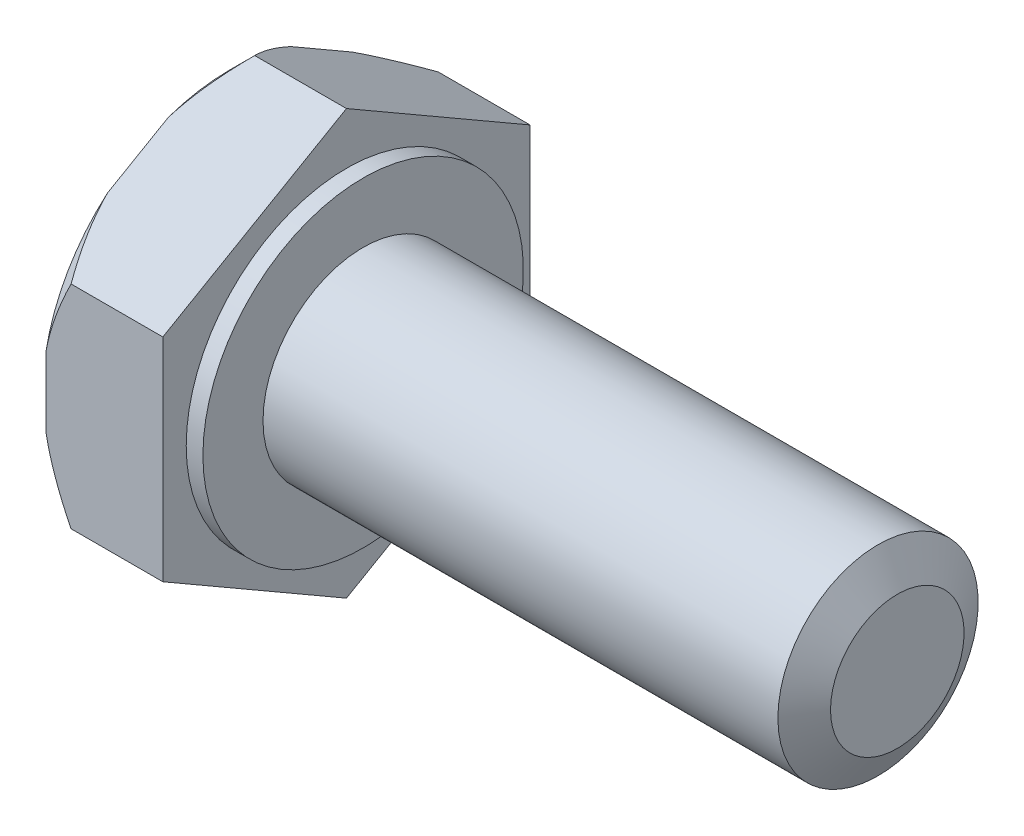
ISO-10303-21;
HEADER;
FILE_DESCRIPTION(('STEP AP214'),'2;1');
FILE_NAME('part.step','',(''),(''),'','','');
FILE_SCHEMA(('AUTOMOTIVE_DESIGN { 1 0 10303 214 1 1 1 1 }'));
ENDSEC;
DATA;
#1=APPLICATION_CONTEXT('core data for automotive mechanical design processes');
#2=APPLICATION_PROTOCOL_DEFINITION('international standard','automotive_design',2000,#1);
#3=PRODUCT_CONTEXT('',#1,'mechanical');
#4=PRODUCT('Part','Part','',(#3));
#5=PRODUCT_RELATED_PRODUCT_CATEGORY('part','',(#4));
#6=PRODUCT_DEFINITION_FORMATION('','',#4);
#7=PRODUCT_DEFINITION_CONTEXT('part definition',#1,'design');
#8=PRODUCT_DEFINITION('design','',#6,#7);
#9=PRODUCT_DEFINITION_SHAPE('','',#8);
#10=(LENGTH_UNIT() NAMED_UNIT(*) SI_UNIT(.MILLI.,.METRE.));
#11=(NAMED_UNIT(*) PLANE_ANGLE_UNIT() SI_UNIT($,.RADIAN.));
#12=(NAMED_UNIT(*) SI_UNIT($,.STERADIAN.) SOLID_ANGLE_UNIT());
#13=UNCERTAINTY_MEASURE_WITH_UNIT(LENGTH_MEASURE(1.E-05),#10,'distance_accuracy_value','');
#14=(GEOMETRIC_REPRESENTATION_CONTEXT(3) GLOBAL_UNCERTAINTY_ASSIGNED_CONTEXT((#13)) GLOBAL_UNIT_ASSIGNED_CONTEXT((#10,
#11,#12)) REPRESENTATION_CONTEXT('',''));
#15=CARTESIAN_POINT('',(0.,0.,0.));
#16=DIRECTION('',(0.,0.,1.));
#17=DIRECTION('',(1.,0.,0.));
#18=AXIS2_PLACEMENT_3D('',#15,#16,#17);
#19=CARTESIAN_POINT('',(-0.25,2.4,0.));
#20=DIRECTION('',(-1.,0.,0.));
#21=DIRECTION('',(0.,0.,1.));
#22=AXIS2_PLACEMENT_3D('',#19,#20,#21);
#23=PLANE('',#22);
#24=CARTESIAN_POINT('',(-0.25,0.,0.));
#25=DIRECTION('',(-1.,0.,0.));
#26=DIRECTION('',(0.,0.,1.));
#27=AXIS2_PLACEMENT_3D('',#24,#25,#26);
#28=CIRCLE('',#27,2.4);
#29=CARTESIAN_POINT('',(-0.25,0.,2.4));
#30=VERTEX_POINT('',#29);
#31=EDGE_CURVE('E228',#30,#30,#28,.T.);
#32=ORIENTED_EDGE('',*,*,#31,.T.);
#33=EDGE_LOOP('',(#32));
#34=FACE_BOUND('',#33,.T.);
#35=DIRECTION('',(0.,-0.5,-0.866025403784439));
#36=VECTOR('',#35,1.);
#37=CARTESIAN_POINT('',(-0.25,2.98156986040721,-0.335769515458674));
#38=LINE('',#37,#36);
#39=CARTESIAN_POINT('',(-0.25,3.17542648054294,0.));
#40=VERTEX_POINT('',#39);
#41=CARTESIAN_POINT('',(-0.25,1.58771324027147,-2.75));
#42=VERTEX_POINT('',#41);
#43=EDGE_CURVE('E12',#40,#42,#38,.T.);
#44=ORIENTED_EDGE('',*,*,#43,.F.);
#45=DIRECTION('',(0.,0.5,-0.866025403784439));
#46=VECTOR('',#45,1.);
#47=CARTESIAN_POINT('',(-0.25,2.98156986040721,0.335769515458674));
#48=LINE('',#47,#46);
#49=CARTESIAN_POINT('',(-0.25,1.58771324027147,2.75));
#50=VERTEX_POINT('',#49);
#51=EDGE_CURVE('E244',#50,#40,#48,.T.);
#52=ORIENTED_EDGE('',*,*,#51,.F.);
#53=DIRECTION('',(0.,1.,0.));
#54=VECTOR('',#53,1.);
#55=CARTESIAN_POINT('',(-0.25,2.4,2.75));
#56=LINE('',#55,#54);
#57=CARTESIAN_POINT('',(-0.25,-1.58771324027147,2.75));
#58=VERTEX_POINT('',#57);
#59=EDGE_CURVE('E147',#58,#50,#56,.T.);
#60=ORIENTED_EDGE('',*,*,#59,.F.);
#61=DIRECTION('',(0.,0.5,0.866025403784439));
#62=VECTOR('',#61,1.);
#63=CARTESIAN_POINT('',(-0.25,-1.7815698604072,2.41423048454133));
#64=LINE('',#63,#62);
#65=CARTESIAN_POINT('',(-0.25,-3.17542648054294,0.));
#66=VERTEX_POINT('',#65);
#67=EDGE_CURVE('E249',#66,#58,#64,.T.);
#68=ORIENTED_EDGE('',*,*,#67,.F.);
#69=DIRECTION('',(0.,-0.5,0.866025403784439));
#70=VECTOR('',#69,1.);
#71=CARTESIAN_POINT('',(-0.25,-1.78156986040721,-2.41423048454132));
#72=LINE('',#71,#70);
#73=CARTESIAN_POINT('',(-0.25,-1.58771324027147,-2.75));
#74=VERTEX_POINT('',#73);
#75=EDGE_CURVE('E252',#74,#66,#72,.T.);
#76=ORIENTED_EDGE('',*,*,#75,.F.);
#77=DIRECTION('',(0.,-1.,0.));
#78=VECTOR('',#77,1.);
#79=CARTESIAN_POINT('',(-0.25,2.4,-2.75));
#80=LINE('',#79,#78);
#81=EDGE_CURVE('E55',#42,#74,#80,.T.);
#82=ORIENTED_EDGE('',*,*,#81,.F.);
#83=EDGE_LOOP('',(#44,#52,#60,#68,#76,#82));
#84=FACE_BOUND('',#83,.T.);
#85=ADVANCED_FACE('F46',(#34,#84),#23,.F.);
#86=CARTESIAN_POINT('',(-88.99,0.,0.));
#87=DIRECTION('',(-1.,0.,0.));
#88=DIRECTION('',(0.,0.,1.));
#89=AXIS2_PLACEMENT_3D('',#86,#87,#88);
#90=CYLINDRICAL_SURFACE('',#89,1.5);
#91=CARTESIAN_POINT('',(0.,0.,0.));
#92=DIRECTION('',(-1.,0.,0.));
#93=DIRECTION('',(0.,0.,1.));
#94=AXIS2_PLACEMENT_3D('',#91,#92,#93);
#95=CIRCLE('',#94,1.49999999999999);
#96=CARTESIAN_POINT('',(0.,0.,1.49999999999999));
#97=VERTEX_POINT('',#96);
#98=EDGE_CURVE('E220',#97,#97,#95,.T.);
#99=ORIENTED_EDGE('',*,*,#98,.F.);
#100=EDGE_LOOP('',(#99));
#101=FACE_BOUND('',#100,.T.);
#102=CARTESIAN_POINT('',(7.71132486540518,0.,0.));
#103=DIRECTION('',(-1.,0.,0.));
#104=DIRECTION('',(0.,0.,1.));
#105=AXIS2_PLACEMENT_3D('',#102,#103,#104);
#106=CIRCLE('',#105,1.5);
#107=CARTESIAN_POINT('',(7.71132486540518,0.,1.5));
#108=VERTEX_POINT('',#107);
#109=EDGE_CURVE('E240',#108,#108,#106,.T.);
#110=ORIENTED_EDGE('',*,*,#109,.T.);
#111=EDGE_LOOP('',(#110));
#112=FACE_BOUND('',#111,.T.);
#113=ADVANCED_FACE('F48',(#101,#112),#90,.T.);
#114=CARTESIAN_POINT('',(7.99999999999999,0.,0.));
#115=DIRECTION('',(-1.,0.,0.));
#116=DIRECTION('',(0.,0.,1.));
#117=AXIS2_PLACEMENT_3D('',#114,#115,#116);
#118=CONICAL_SURFACE('',#117,0.999999999999993,1.04719755119661);
#119=ORIENTED_EDGE('',*,*,#109,.F.);
#120=EDGE_LOOP('',(#119));
#121=FACE_BOUND('',#120,.T.);
#122=CARTESIAN_POINT('',(7.99999999999999,0.,0.));
#123=DIRECTION('',(-1.,0.,0.));
#124=DIRECTION('',(0.,0.,1.));
#125=AXIS2_PLACEMENT_3D('',#122,#123,#124);
#126=CIRCLE('',#125,0.999999999999993);
#127=CARTESIAN_POINT('',(7.99999999999999,0.,0.999999999999993));
#128=VERTEX_POINT('',#127);
#129=EDGE_CURVE('E235',#128,#128,#126,.T.);
#130=ORIENTED_EDGE('',*,*,#129,.T.);
#131=EDGE_LOOP('',(#130));
#132=FACE_BOUND('',#131,.T.);
#133=ADVANCED_FACE('F364',(#121,#132),#118,.T.);
#134=CARTESIAN_POINT('',(8.,0.,0.));
#135=DIRECTION('',(-1.,0.,0.));
#136=DIRECTION('',(0.,0.,1.));
#137=AXIS2_PLACEMENT_3D('',#134,#135,#136);
#138=PLANE('',#137);
#139=ORIENTED_EDGE('',*,*,#129,.F.);
#140=EDGE_LOOP('',(#139));
#141=FACE_BOUND('',#140,.T.);
#142=ADVANCED_FACE('F368',(#141),#138,.F.);
#143=CARTESIAN_POINT('',(-88.99,0.,0.));
#144=DIRECTION('',(-1.,0.,0.));
#145=DIRECTION('',(0.,0.,1.));
#146=AXIS2_PLACEMENT_3D('',#143,#144,#145);
#147=CYLINDRICAL_SURFACE('',#146,2.4);
#148=ORIENTED_EDGE('',*,*,#31,.F.);
#149=EDGE_LOOP('',(#148));
#150=FACE_BOUND('',#149,.T.);
#151=CARTESIAN_POINT('',(0.,0.,0.));
#152=DIRECTION('',(-1.,0.,0.));
#153=DIRECTION('',(0.,0.,1.));
#154=AXIS2_PLACEMENT_3D('',#151,#152,#153);
#155=CIRCLE('',#154,2.4);
#156=CARTESIAN_POINT('',(0.,0.,2.4));
#157=VERTEX_POINT('',#156);
#158=EDGE_CURVE('E224',#157,#157,#155,.T.);
#159=ORIENTED_EDGE('',*,*,#158,.T.);
#160=EDGE_LOOP('',(#159));
#161=FACE_BOUND('',#160,.T.);
#162=ADVANCED_FACE('F366',(#150,#161),#147,.T.);
#163=CARTESIAN_POINT('',(0.,1.49999999999999,0.));
#164=DIRECTION('',(-1.,0.,0.));
#165=DIRECTION('',(0.,0.,1.));
#166=AXIS2_PLACEMENT_3D('',#163,#164,#165);
#167=PLANE('',#166);
#168=ORIENTED_EDGE('',*,*,#158,.F.);
#169=EDGE_LOOP('',(#168));
#170=FACE_BOUND('',#169,.T.);
#171=ORIENTED_EDGE('',*,*,#98,.T.);
#172=EDGE_LOOP('',(#171));
#173=FACE_BOUND('',#172,.T.);
#174=ADVANCED_FACE('F201',(#170,#173),#167,.F.);
#175=CARTESIAN_POINT('',(-10.,1.58771324027147,-2.75));
#176=DIRECTION('',(0.,0.866025403784439,-0.5));
#177=DIRECTION('',(0.,0.5,0.866025403784439));
#178=AXIS2_PLACEMENT_3D('',#175,#176,#177);
#179=PLANE('',#178);
#180=CARTESIAN_POINT('',(-1.62416929712346,1.58730909508304,-2.7507));
#181=CARTESIAN_POINT('',(-1.67873240689728,1.64190394574507,-2.65613894482172));
#182=CARTESIAN_POINT('',(-1.73009230485526,1.69741186986075,-2.55999640003069));
#183=CARTESIAN_POINT('',(-1.82413348159342,1.81059965280804,-2.3639494091699));
#184=CARTESIAN_POINT('',(-1.86676239408052,1.86829029135513,-2.26402629208526));
#185=CARTESIAN_POINT('',(-1.93978791121201,1.98462089696779,-2.06253577268887));
#186=CARTESIAN_POINT('',(-1.97036818573914,2.0432311969159,-1.9610197553319));
#187=CARTESIAN_POINT('',(-2.01748472623419,2.16174293490575,-1.75575140384018));
#188=CARTESIAN_POINT('',(-2.03405619713009,2.22164074614133,-1.65200535151798));
#189=CARTESIAN_POINT('',(-2.04900701918514,2.32485727641031,-1.47322907691115));
#190=CARTESIAN_POINT('',(-2.05122181954387,2.36804242453519,-1.39843020622645));
#191=CARTESIAN_POINT('',(-2.04750197584862,2.45434228355484,-1.24895446571839));
#192=CARTESIAN_POINT('',(-2.04156447346728,2.49745696443535,-1.17427764788124));
#193=CARTESIAN_POINT('',(-2.02187788996436,2.58327939107974,-1.0256288445043));
#194=CARTESIAN_POINT('',(-2.00812005958735,2.62598662649376,-0.951657742916417));
#195=CARTESIAN_POINT('',(-1.97354808724309,2.71066264339809,-0.804994579455557));
#196=CARTESIAN_POINT('',(-1.95273448573815,2.75263148118971,-0.73230242006585));
#197=CARTESIAN_POINT('',(-1.89091200841835,2.86018628329314,-0.546012038224695));
#198=CARTESIAN_POINT('',(-1.84523197416098,2.92510389813121,-0.433571431018963));
#199=CARTESIAN_POINT('',(-1.76811300012925,3.02055803067228,-0.268240023665414));
#200=CARTESIAN_POINT('',(-1.74101618948653,3.05201421245942,-0.213756318597968));
#201=CARTESIAN_POINT('',(-1.68435170080201,3.11434339169482,-0.105799013368192));
#202=CARTESIAN_POINT('',(-1.65478554533338,3.14521673432528,-0.0523248153327461));
#203=CARTESIAN_POINT('',(-1.62416929712346,3.17583062573137,0.00070000000000053));
#204=B_SPLINE_CURVE_WITH_KNOTS('',3,(#180,#181,#182,#183,#184,#185,#186,#187,#188,#189,#190,
#191,#192,#193,#194,#195,#196,#197,#198,#199,#200,#201,#202,#203),.UNSPECIFIED.,.F.,.F.,(4,2,2,
2,2,2,2,2,2,2,2,4),(0.,0.366444677366511,0.735026686082085,1.09774982664137,1.45955869013897,
1.71838791151527,1.97730790572206,2.23651814714986,2.49570853791605,2.9077522118403,
3.11321593620645,3.31855389598318),.UNSPECIFIED.);
#205=CARTESIAN_POINT('',(-1.62457351945706,1.58771324027147,-2.75));
#206=VERTEX_POINT('',#205);
#207=CARTESIAN_POINT('',(-2.,2.11817851658589,-1.83120718977236));
#208=VERTEX_POINT('',#207);
#209=EDGE_CURVE('E215',#206,#208,#204,.T.);
#210=ORIENTED_EDGE('',*,*,#209,.T.);
#211=DIRECTION('',(0.,0.5,0.866025403784439));
#212=VECTOR('',#211,1.);
#213=CARTESIAN_POINT('',(-2.,3.08156986040721,-0.162564434701786));
#214=LINE('',#213,#212);
#215=CARTESIAN_POINT('',(-2.,2.64496120422852,-0.918792810227635));
#216=VERTEX_POINT('',#215);
#217=EDGE_CURVE('E213',#208,#216,#214,.T.);
#218=ORIENTED_EDGE('',*,*,#217,.T.);
#219=CARTESIAN_POINT('',(-1.62457351945706,3.17542648054294,0.));
#220=VERTEX_POINT('',#219);
#221=EDGE_CURVE('E205',#216,#220,#204,.T.);
#222=ORIENTED_EDGE('',*,*,#221,.T.);
#223=DIRECTION('',(1.,0.,0.));
#224=VECTOR('',#223,1.);
#225=CARTESIAN_POINT('',(-10.,3.17542648054294,0.));
#226=LINE('',#225,#224);
#227=EDGE_CURVE('E151',#220,#40,#226,.T.);
#228=ORIENTED_EDGE('',*,*,#227,.T.);
#229=ORIENTED_EDGE('',*,*,#43,.T.);
#230=DIRECTION('',(1.,0.,0.));
#231=VECTOR('',#230,1.);
#232=CARTESIAN_POINT('',(-10.,1.58771324027147,-2.75));
#233=LINE('',#232,#231);
#234=EDGE_CURVE('E138',#206,#42,#233,.T.);
#235=ORIENTED_EDGE('',*,*,#234,.F.);
#236=EDGE_LOOP('',(#210,#218,#222,#228,#229,#235));
#237=FACE_BOUND('',#236,.T.);
#238=ADVANCED_FACE('F196',(#237),#179,.T.);
#239=CARTESIAN_POINT('',(-10.,-1.58771324027147,-2.75));
#240=DIRECTION('',(0.,0.,-1.));
#241=DIRECTION('',(-1.,0.,0.));
#242=AXIS2_PLACEMENT_3D('',#239,#240,#241);
#243=PLANE('',#242);
#244=CARTESIAN_POINT('',(-1.6242234615972,-1.58841324027147,-2.75));
#245=CARTESIAN_POINT('',(-1.67878054056564,-1.47923007176462,-2.75));
#246=CARTESIAN_POINT('',(-1.73013450727506,-1.36822093162341,-2.75));
#247=CARTESIAN_POINT('',(-1.82416436911332,-1.14185942744558,-2.75));
#248=CARTESIAN_POINT('',(-1.86678791214681,-1.02648551106449,-2.75));
#249=CARTESIAN_POINT('',(-1.93980397677998,-0.793839212632872,-2.75));
#250=CARTESIAN_POINT('',(-1.97038012135137,-0.676626145678327,-2.75));
#251=CARTESIAN_POINT('',(-2.01749005797603,-0.439618220569901,-2.75));
#252=CARTESIAN_POINT('',(-2.03405904366729,-0.3198306131265,-2.75));
#253=CARTESIAN_POINT('',(-2.04900780116706,-0.11340597790281,-2.75));
#254=CARTESIAN_POINT('',(-2.05122199360228,-0.0270359958073744,-2.75));
#255=CARTESIAN_POINT('',(-2.04750100333486,0.145563035419193,-2.75));
#256=CARTESIAN_POINT('',(-2.04156296258093,0.231792024507563,-2.75));
#257=CARTESIAN_POINT('',(-2.02187540517252,0.403436071615628,-2.75));
#258=CARTESIAN_POINT('',(-2.00811714145772,0.488850109136403,-2.75));
#259=CARTESIAN_POINT('',(-1.9735444165745,0.65820126185142,-2.75));
#260=CARTESIAN_POINT('',(-1.95273049595297,0.742138489668741,-2.75));
#261=CARTESIAN_POINT('',(-1.89091346429589,0.957225607956201,-2.75));
#262=CARTESIAN_POINT('',(-1.84524177588372,1.08703951024291,-2.75));
#263=CARTESIAN_POINT('',(-1.76813783343542,1.27791701296913,-2.75));
#264=CARTESIAN_POINT('',(-1.74104645121245,1.34081932414941,-2.75));
#265=CARTESIAN_POINT('',(-1.68439346815818,1.46545796284275,-2.75));
#266=CARTESIAN_POINT('',(-1.65483338839076,1.5271949800054,-2.75));
#267=CARTESIAN_POINT('',(-1.6242234615972,1.58841324027147,-2.75));
#268=B_SPLINE_CURVE_WITH_KNOTS('',3,(#244,#245,#246,#247,#248,#249,#250,#251,#252,#253,#254,
#255,#256,#257,#258,#259,#260,#261,#262,#263,#264,#265,#266,#267),.UNSPECIFIED.,.F.,.F.,(4,2,2,
2,2,2,2,2,2,2,2,4),(0.,0.366419001317121,0.734974757573917,1.09767300568625,1.45945722599858,
1.71828545834729,1.97720445518716,2.23641362909671,2.49560294900025,2.90757839151832,
3.11300798606268,3.31831192800726),.UNSPECIFIED.);
#269=CARTESIAN_POINT('',(-1.62457351945706,-1.58771324027147,-2.75));
#270=VERTEX_POINT('',#269);
#271=CARTESIAN_POINT('',(-2.,-0.526782687642644,-2.75));
#272=VERTEX_POINT('',#271);
#273=EDGE_CURVE('E214',#270,#272,#268,.T.);
#274=ORIENTED_EDGE('',*,*,#273,.T.);
#275=DIRECTION('',(0.,1.,0.));
#276=VECTOR('',#275,1.);
#277=CARTESIAN_POINT('',(-2.,2.8,-2.75));
#278=LINE('',#277,#276);
#279=CARTESIAN_POINT('',(-2.,0.526782687642644,-2.75));
#280=VERTEX_POINT('',#279);
#281=EDGE_CURVE('E216',#272,#280,#278,.T.);
#282=ORIENTED_EDGE('',*,*,#281,.T.);
#283=EDGE_CURVE('E339',#280,#206,#268,.T.);
#284=ORIENTED_EDGE('',*,*,#283,.T.);
#285=ORIENTED_EDGE('',*,*,#234,.T.);
#286=ORIENTED_EDGE('',*,*,#81,.T.);
#287=DIRECTION('',(1.,0.,0.));
#288=VECTOR('',#287,1.);
#289=CARTESIAN_POINT('',(-10.,-1.58771324027147,-2.75));
#290=LINE('',#289,#288);
#291=EDGE_CURVE('E260',#270,#74,#290,.T.);
#292=ORIENTED_EDGE('',*,*,#291,.F.);
#293=EDGE_LOOP('',(#274,#282,#284,#285,#286,#292));
#294=FACE_BOUND('',#293,.T.);
#295=ADVANCED_FACE('F200',(#294),#243,.T.);
#296=CARTESIAN_POINT('',(-10.,-3.17542648054294,0.));
#297=DIRECTION('',(0.,-0.866025403784439,-0.5));
#298=DIRECTION('',(0.,0.5,-0.866025403784439));
#299=AXIS2_PLACEMENT_3D('',#296,#297,#298);
#300=PLANE('',#299);
#301=CARTESIAN_POINT('',(-1.62416929712346,-3.17583062573137,0.000699999999999747));
#302=CARTESIAN_POINT('',(-1.67873240689728,-3.12123577506934,-0.0938610551782793));
#303=CARTESIAN_POINT('',(-1.73009230485526,-3.06572785095366,-0.190003599969308));
#304=CARTESIAN_POINT('',(-1.82413348159342,-2.95254006800637,-0.386050590830101));
#305=CARTESIAN_POINT('',(-1.86676239408052,-2.89484942945929,-0.48597370791474));
#306=CARTESIAN_POINT('',(-1.93978791121201,-2.77851882384662,-0.687464227311125));
#307=CARTESIAN_POINT('',(-1.97036818573914,-2.71990852389852,-0.788980244668101));
#308=CARTESIAN_POINT('',(-2.01748472623419,-2.60139678590866,-0.994248596159818));
#309=CARTESIAN_POINT('',(-2.03405619713009,-2.54149897467308,-1.09799464848202));
#310=CARTESIAN_POINT('',(-2.04900701918514,-2.43828244440411,-1.27677092308885));
#311=CARTESIAN_POINT('',(-2.05122181954387,-2.39509729627922,-1.35156979377354));
#312=CARTESIAN_POINT('',(-2.04750197584862,-2.30879743725957,-1.5010455342816));
#313=CARTESIAN_POINT('',(-2.04156447346728,-2.26568275637907,-1.57572235211876));
#314=CARTESIAN_POINT('',(-2.02187788996436,-2.17986032973467,-1.7243711554957));
#315=CARTESIAN_POINT('',(-2.00812005958735,-2.13715309432066,-1.79834225708358));
#316=CARTESIAN_POINT('',(-1.97354808724309,-2.05247707741633,-1.94500542054444));
#317=CARTESIAN_POINT('',(-1.95273448573815,-2.0105082396247,-2.01769757993415));
#318=CARTESIAN_POINT('',(-1.89091200841835,-1.90295343752128,-2.2039879617753));
#319=CARTESIAN_POINT('',(-1.84523197416098,-1.8380358226832,-2.31642856898104));
#320=CARTESIAN_POINT('',(-1.76811300012925,-1.74258169014213,-2.48175997633458));
#321=CARTESIAN_POINT('',(-1.74101618948654,-1.71112550835499,-2.53624368140203));
#322=CARTESIAN_POINT('',(-1.68435170080201,-1.64879632911959,-2.64420098663181));
#323=CARTESIAN_POINT('',(-1.65478554533338,-1.61792298648913,-2.69767518466725));
#324=CARTESIAN_POINT('',(-1.62416929712346,-1.58730909508304,-2.7507));
#325=B_SPLINE_CURVE_WITH_KNOTS('',3,(#301,#302,#303,#304,#305,#306,#307,#308,#309,#310,#311,
#312,#313,#314,#315,#316,#317,#318,#319,#320,#321,#322,#323,#324),.UNSPECIFIED.,.F.,.F.,(4,2,2,
2,2,2,2,2,2,2,2,4),(0.,0.366444677366512,0.735026686082084,1.09774982664137,1.45955869013897,
1.71838791151527,1.97730790572206,2.23651814714986,2.49570853791605,2.9077522118403,
3.11321593620645,3.31855389598317),.UNSPECIFIED.);
#326=CARTESIAN_POINT('',(-1.62457351945706,-3.17542648054294,0.));
#327=VERTEX_POINT('',#326);
#328=CARTESIAN_POINT('',(-2.,-2.64496120422853,-0.918792810227628));
#329=VERTEX_POINT('',#328);
#330=EDGE_CURVE('E320',#327,#329,#325,.T.);
#331=ORIENTED_EDGE('',*,*,#330,.T.);
#332=DIRECTION('',(0.,0.5,-0.866025403784439));
#333=VECTOR('',#332,1.);
#334=CARTESIAN_POINT('',(-2.,-1.68156986040721,-2.58743556529821));
#335=LINE('',#334,#333);
#336=CARTESIAN_POINT('',(-2.,-2.11817851658589,-1.83120718977237));
#337=VERTEX_POINT('',#336);
#338=EDGE_CURVE('E318',#329,#337,#335,.T.);
#339=ORIENTED_EDGE('',*,*,#338,.T.);
#340=EDGE_CURVE('E271',#337,#270,#325,.T.);
#341=ORIENTED_EDGE('',*,*,#340,.T.);
#342=ORIENTED_EDGE('',*,*,#291,.T.);
#343=ORIENTED_EDGE('',*,*,#75,.T.);
#344=DIRECTION('',(1.,0.,0.));
#345=VECTOR('',#344,1.);
#346=CARTESIAN_POINT('',(-10.,-3.17542648054294,0.));
#347=LINE('',#346,#345);
#348=EDGE_CURVE('E273',#327,#66,#347,.T.);
#349=ORIENTED_EDGE('',*,*,#348,.F.);
#350=EDGE_LOOP('',(#331,#339,#341,#342,#343,#349));
#351=FACE_BOUND('',#350,.T.);
#352=ADVANCED_FACE('F267',(#351),#300,.T.);
#353=CARTESIAN_POINT('',(-10.,-1.58771324027147,2.75));
#354=DIRECTION('',(0.,-0.866025403784439,0.5));
#355=DIRECTION('',(0.,-0.5,-0.866025403784439));
#356=AXIS2_PLACEMENT_3D('',#353,#354,#355);
#357=PLANE('',#356);
#358=CARTESIAN_POINT('',(-1.62416929712346,-1.58730909508304,2.7507));
#359=CARTESIAN_POINT('',(-1.67873240689728,-1.64190394574507,2.65613894482172));
#360=CARTESIAN_POINT('',(-1.73009230485526,-1.69741186986075,2.55999640003069));
#361=CARTESIAN_POINT('',(-1.82413348159342,-1.81059965280804,2.3639494091699));
#362=CARTESIAN_POINT('',(-1.86676239408052,-1.86829029135513,2.26402629208526));
#363=CARTESIAN_POINT('',(-1.93978791121201,-1.98462089696779,2.06253577268887));
#364=CARTESIAN_POINT('',(-1.97036818573914,-2.0432311969159,1.9610197553319));
#365=CARTESIAN_POINT('',(-2.01748472623419,-2.16174293490575,1.75575140384018));
#366=CARTESIAN_POINT('',(-2.03405619713009,-2.22164074614133,1.65200535151798));
#367=CARTESIAN_POINT('',(-2.04900701918514,-2.3248572764103,1.47322907691115));
#368=CARTESIAN_POINT('',(-2.05122181954387,-2.36804242453519,1.39843020622646));
#369=CARTESIAN_POINT('',(-2.04750197584862,-2.45434228355484,1.24895446571839));
#370=CARTESIAN_POINT('',(-2.04156447346728,-2.49745696443535,1.17427764788124));
#371=CARTESIAN_POINT('',(-2.02187788996436,-2.58327939107974,1.0256288445043));
#372=CARTESIAN_POINT('',(-2.00812005958735,-2.62598662649375,0.951657742916418));
#373=CARTESIAN_POINT('',(-1.97354808724309,-2.71066264339808,0.804994579455558));
#374=CARTESIAN_POINT('',(-1.95273448573815,-2.75263148118971,0.73230242006585));
#375=CARTESIAN_POINT('',(-1.89091200841835,-2.86018628329314,0.546012038224696));
#376=CARTESIAN_POINT('',(-1.84523197416098,-2.92510389813121,0.433571431018963));
#377=CARTESIAN_POINT('',(-1.76811300012925,-3.02055803067228,0.268240023665415));
#378=CARTESIAN_POINT('',(-1.74101618948654,-3.05201421245942,0.213756318597968));
#379=CARTESIAN_POINT('',(-1.68435170080201,-3.11434339169482,0.105799013368192));
#380=CARTESIAN_POINT('',(-1.65478554533338,-3.14521673432528,0.0523248153327464));
#381=CARTESIAN_POINT('',(-1.62416929712346,-3.17583062573137,-0.00070000000000051));
#382=B_SPLINE_CURVE_WITH_KNOTS('',3,(#358,#359,#360,#361,#362,#363,#364,#365,#366,#367,#368,
#369,#370,#371,#372,#373,#374,#375,#376,#377,#378,#379,#380,#381),.UNSPECIFIED.,.F.,.F.,(4,2,2,
2,2,2,2,2,2,2,2,4),(0.,0.366444677366512,0.735026686082085,1.09774982664137,1.45955869013897,
1.71838791151527,1.97730790572206,2.23651814714986,2.49570853791605,2.9077522118403,
3.11321593620645,3.31855389598318),.UNSPECIFIED.);
#383=CARTESIAN_POINT('',(-1.62457351945706,-1.58771324027147,2.75));
#384=VERTEX_POINT('',#383);
#385=CARTESIAN_POINT('',(-2.,-2.11817851658588,1.83120718977237));
#386=VERTEX_POINT('',#385);
#387=EDGE_CURVE('E164',#384,#386,#382,.T.);
#388=ORIENTED_EDGE('',*,*,#387,.T.);
#389=DIRECTION('',(0.,-0.5,-0.866025403784439));
#390=VECTOR('',#389,1.);
#391=CARTESIAN_POINT('',(-2.,-1.68156986040721,2.58743556529821));
#392=LINE('',#391,#390);
#393=CARTESIAN_POINT('',(-2.,-2.64496120422853,0.918792810227628));
#394=VERTEX_POINT('',#393);
#395=EDGE_CURVE('E162',#386,#394,#392,.T.);
#396=ORIENTED_EDGE('',*,*,#395,.T.);
#397=EDGE_CURVE('E156',#394,#327,#382,.T.);
#398=ORIENTED_EDGE('',*,*,#397,.T.);
#399=ORIENTED_EDGE('',*,*,#348,.T.);
#400=ORIENTED_EDGE('',*,*,#67,.T.);
#401=DIRECTION('',(1.,0.,0.));
#402=VECTOR('',#401,1.);
#403=CARTESIAN_POINT('',(-10.,-1.58771324027147,2.75));
#404=LINE('',#403,#402);
#405=EDGE_CURVE('E150',#384,#58,#404,.T.);
#406=ORIENTED_EDGE('',*,*,#405,.F.);
#407=EDGE_LOOP('',(#388,#396,#398,#399,#400,#406));
#408=FACE_BOUND('',#407,.T.);
#409=ADVANCED_FACE('F277',(#408),#357,.T.);
#410=CARTESIAN_POINT('',(-10.,1.58771324027147,2.75));
#411=DIRECTION('',(0.,0.,1.));
#412=DIRECTION('',(0.,-1.,0.));
#413=AXIS2_PLACEMENT_3D('',#410,#411,#412);
#414=PLANE('',#413);
#415=CARTESIAN_POINT('',(-1.62422346159719,1.58841324027147,2.75));
#416=CARTESIAN_POINT('',(-1.67878054056564,1.47923007176462,2.75));
#417=CARTESIAN_POINT('',(-1.73013450727506,1.36822093162341,2.75));
#418=CARTESIAN_POINT('',(-1.82416436911331,1.14185942744558,2.75));
#419=CARTESIAN_POINT('',(-1.86678791214681,1.02648551106449,2.75));
#420=CARTESIAN_POINT('',(-1.93980397677998,0.793839212632872,2.75));
#421=CARTESIAN_POINT('',(-1.97038012135137,0.676626145678327,2.75));
#422=CARTESIAN_POINT('',(-2.01749005797603,0.439618220569901,2.75));
#423=CARTESIAN_POINT('',(-2.03405904366729,0.3198306131265,2.75));
#424=CARTESIAN_POINT('',(-2.04900780116706,0.113405977902811,2.75));
#425=CARTESIAN_POINT('',(-2.05122199360228,0.0270359958073744,2.75));
#426=CARTESIAN_POINT('',(-2.04750100333486,-0.145563035419193,2.75));
#427=CARTESIAN_POINT('',(-2.04156296258093,-0.231792024507563,2.75));
#428=CARTESIAN_POINT('',(-2.02187540517252,-0.403436071615629,2.75));
#429=CARTESIAN_POINT('',(-2.00811714145772,-0.488850109136403,2.75));
#430=CARTESIAN_POINT('',(-1.9735444165745,-0.658201261851421,2.75));
#431=CARTESIAN_POINT('',(-1.95273049595297,-0.742138489668742,2.75));
#432=CARTESIAN_POINT('',(-1.89091346429589,-0.957225607956201,2.75));
#433=CARTESIAN_POINT('',(-1.84524177588372,-1.08703951024291,2.75));
#434=CARTESIAN_POINT('',(-1.76813783343542,-1.27791701296913,2.75));
#435=CARTESIAN_POINT('',(-1.74104645121245,-1.34081932414941,2.75));
#436=CARTESIAN_POINT('',(-1.68439346815818,-1.46545796284275,2.75));
#437=CARTESIAN_POINT('',(-1.65483338839076,-1.5271949800054,2.75));
#438=CARTESIAN_POINT('',(-1.6242234615972,-1.58841324027147,2.75));
#439=B_SPLINE_CURVE_WITH_KNOTS('',3,(#415,#416,#417,#418,#419,#420,#421,#422,#423,#424,#425,
#426,#427,#428,#429,#430,#431,#432,#433,#434,#435,#436,#437,#438),.UNSPECIFIED.,.F.,.F.,(4,2,2,
2,2,2,2,2,2,2,2,4),(0.,0.366419001317121,0.734974757573917,1.09767300568625,1.45945722599858,
1.71828545834729,1.97720445518716,2.23641362909671,2.49560294900025,2.90757839151832,
3.11300798606267,3.31831192800726),.UNSPECIFIED.);
#440=CARTESIAN_POINT('',(-1.62457351945706,1.58771324027147,2.75));
#441=VERTEX_POINT('',#440);
#442=CARTESIAN_POINT('',(-2.,0.526782687642642,2.75));
#443=VERTEX_POINT('',#442);
#444=EDGE_CURVE('E143',#441,#443,#439,.T.);
#445=ORIENTED_EDGE('',*,*,#444,.T.);
#446=DIRECTION('',(0.,-1.,0.));
#447=VECTOR('',#446,1.);
#448=CARTESIAN_POINT('',(-2.,2.8,2.75));
#449=LINE('',#448,#447);
#450=CARTESIAN_POINT('',(-2.,-0.526782687642642,2.75));
#451=VERTEX_POINT('',#450);
#452=EDGE_CURVE('E157',#443,#451,#449,.T.);
#453=ORIENTED_EDGE('',*,*,#452,.T.);
#454=EDGE_CURVE('E159',#451,#384,#439,.T.);
#455=ORIENTED_EDGE('',*,*,#454,.T.);
#456=ORIENTED_EDGE('',*,*,#405,.T.);
#457=ORIENTED_EDGE('',*,*,#59,.T.);
#458=DIRECTION('',(1.,0.,0.));
#459=VECTOR('',#458,1.);
#460=CARTESIAN_POINT('',(-10.,1.58771324027147,2.75));
#461=LINE('',#460,#459);
#462=EDGE_CURVE('E68',#441,#50,#461,.T.);
#463=ORIENTED_EDGE('',*,*,#462,.F.);
#464=EDGE_LOOP('',(#445,#453,#455,#456,#457,#463));
#465=FACE_BOUND('',#464,.T.);
#466=ADVANCED_FACE('F142',(#465),#414,.T.);
#467=CARTESIAN_POINT('',(-10.,3.17542648054294,0.));
#468=DIRECTION('',(0.,0.866025403784439,0.5));
#469=DIRECTION('',(0.,-0.5,0.866025403784439));
#470=AXIS2_PLACEMENT_3D('',#467,#468,#469);
#471=PLANE('',#470);
#472=CARTESIAN_POINT('',(-1.62416929712346,3.17583062573137,-0.000699999999999561));
#473=CARTESIAN_POINT('',(-1.67873240689728,3.12123577506934,0.0938610551782792));
#474=CARTESIAN_POINT('',(-1.73009230485526,3.06572785095366,0.190003599969308));
#475=CARTESIAN_POINT('',(-1.82413348159342,2.95254006800637,0.386050590830101));
#476=CARTESIAN_POINT('',(-1.86676239408051,2.89484942945929,0.48597370791474));
#477=CARTESIAN_POINT('',(-1.93978791121201,2.77851882384663,0.687464227311126));
#478=CARTESIAN_POINT('',(-1.97036818573914,2.71990852389852,0.788980244668102));
#479=CARTESIAN_POINT('',(-2.01748472623419,2.60139678590866,0.99424859615982));
#480=CARTESIAN_POINT('',(-2.03405619713009,2.54149897467308,1.09799464848202));
#481=CARTESIAN_POINT('',(-2.04900701918514,2.43828244440411,1.27677092308885));
#482=CARTESIAN_POINT('',(-2.05122181954387,2.39509729627922,1.35156979377355));
#483=CARTESIAN_POINT('',(-2.04750197584862,2.30879743725957,1.50104553428161));
#484=CARTESIAN_POINT('',(-2.04156447346728,2.26568275637906,1.57572235211876));
#485=CARTESIAN_POINT('',(-2.02187788996436,2.17986032973467,1.7243711554957));
#486=CARTESIAN_POINT('',(-2.00812005958735,2.13715309432066,1.79834225708358));
#487=CARTESIAN_POINT('',(-1.97354808724309,2.05247707741633,1.94500542054444));
#488=CARTESIAN_POINT('',(-1.95273448573815,2.0105082396247,2.01769757993415));
#489=CARTESIAN_POINT('',(-1.89091200841835,1.90295343752127,2.20398796177531));
#490=CARTESIAN_POINT('',(-1.84523197416098,1.8380358226832,2.31642856898104));
#491=CARTESIAN_POINT('',(-1.76811300012925,1.74258169014213,2.48175997633458));
#492=CARTESIAN_POINT('',(-1.74101618948654,1.71112550835499,2.53624368140203));
#493=CARTESIAN_POINT('',(-1.68435170080201,1.64879632911959,2.64420098663181));
#494=CARTESIAN_POINT('',(-1.65478554533338,1.61792298648913,2.69767518466725));
#495=CARTESIAN_POINT('',(-1.62416929712346,1.58730909508304,2.7507));
#496=B_SPLINE_CURVE_WITH_KNOTS('',3,(#472,#473,#474,#475,#476,#477,#478,#479,#480,#481,#482,
#483,#484,#485,#486,#487,#488,#489,#490,#491,#492,#493,#494,#495),.UNSPECIFIED.,.F.,.F.,(4,2,2,
2,2,2,2,2,2,2,2,4),(0.,0.366444677366512,0.735026686082085,1.09774982664137,1.45955869013897,
1.71838791151527,1.97730790572207,2.23651814714986,2.49570853791606,2.9077522118403,
3.11321593620645,3.31855389598317),.UNSPECIFIED.);
#497=CARTESIAN_POINT('',(-2.,2.64496120422852,0.918792810227639));
#498=VERTEX_POINT('',#497);
#499=EDGE_CURVE('E140',#220,#498,#496,.T.);
#500=ORIENTED_EDGE('',*,*,#499,.T.);
#501=DIRECTION('',(0.,-0.5,0.866025403784439));
#502=VECTOR('',#501,1.);
#503=CARTESIAN_POINT('',(-2.,3.08156986040721,0.162564434701786));
#504=LINE('',#503,#502);
#505=CARTESIAN_POINT('',(-2.,2.11817851658589,1.83120718977236));
#506=VERTEX_POINT('',#505);
#507=EDGE_CURVE('E62',#498,#506,#504,.T.);
#508=ORIENTED_EDGE('',*,*,#507,.T.);
#509=EDGE_CURVE('E131',#506,#441,#496,.T.);
#510=ORIENTED_EDGE('',*,*,#509,.T.);
#511=ORIENTED_EDGE('',*,*,#462,.T.);
#512=ORIENTED_EDGE('',*,*,#51,.T.);
#513=ORIENTED_EDGE('',*,*,#227,.F.);
#514=EDGE_LOOP('',(#500,#508,#510,#511,#512,#513));
#515=FACE_BOUND('',#514,.T.);
#516=ADVANCED_FACE('F132',(#515),#471,.T.);
#517=CARTESIAN_POINT('',(-1.5,0.,0.));
#518=DIRECTION('',(1.,0.,0.));
#519=DIRECTION('',(0.,0.,-1.));
#520=AXIS2_PLACEMENT_3D('',#517,#518,#519);
#521=CONICAL_SURFACE('',#520,3.3,0.785398163397448);
#522=ORIENTED_EDGE('',*,*,#221,.F.);
#523=CARTESIAN_POINT('',(-2.,0.,0.));
#524=DIRECTION('',(-1.,0.,0.));
#525=DIRECTION('',(0.,0.,1.));
#526=AXIS2_PLACEMENT_3D('',#523,#524,#525);
#527=CIRCLE('',#526,2.8);
#528=EDGE_CURVE('E236',#498,#216,#527,.T.);
#529=ORIENTED_EDGE('',*,*,#528,.F.);
#530=ORIENTED_EDGE('',*,*,#499,.F.);
#531=EDGE_LOOP('',(#522,#529,#530));
#532=FACE_BOUND('',#531,.T.);
#533=ADVANCED_FACE('F193',(#532),#521,.T.);
#534=ORIENTED_EDGE('',*,*,#444,.F.);
#535=ORIENTED_EDGE('',*,*,#509,.F.);
#536=EDGE_CURVE('E154',#443,#506,#527,.T.);
#537=ORIENTED_EDGE('',*,*,#536,.F.);
#538=EDGE_LOOP('',(#534,#535,#537));
#539=FACE_BOUND('',#538,.T.);
#540=ADVANCED_FACE('F153',(#539),#521,.T.);
#541=ORIENTED_EDGE('',*,*,#387,.F.);
#542=ORIENTED_EDGE('',*,*,#454,.F.);
#543=EDGE_CURVE('E232',#386,#451,#527,.T.);
#544=ORIENTED_EDGE('',*,*,#543,.F.);
#545=EDGE_LOOP('',(#541,#542,#544));
#546=FACE_BOUND('',#545,.T.);
#547=ADVANCED_FACE('F314',(#546),#521,.T.);
#548=ORIENTED_EDGE('',*,*,#330,.F.);
#549=ORIENTED_EDGE('',*,*,#397,.F.);
#550=EDGE_CURVE('E302',#329,#394,#527,.T.);
#551=ORIENTED_EDGE('',*,*,#550,.F.);
#552=EDGE_LOOP('',(#548,#549,#551));
#553=FACE_BOUND('',#552,.T.);
#554=ADVANCED_FACE('F352',(#553),#521,.T.);
#555=ORIENTED_EDGE('',*,*,#273,.F.);
#556=ORIENTED_EDGE('',*,*,#340,.F.);
#557=EDGE_CURVE('E297',#272,#337,#527,.T.);
#558=ORIENTED_EDGE('',*,*,#557,.F.);
#559=EDGE_LOOP('',(#555,#556,#558));
#560=FACE_BOUND('',#559,.T.);
#561=ADVANCED_FACE('F350',(#560),#521,.T.);
#562=ORIENTED_EDGE('',*,*,#209,.F.);
#563=ORIENTED_EDGE('',*,*,#283,.F.);
#564=EDGE_CURVE('E294',#208,#280,#527,.T.);
#565=ORIENTED_EDGE('',*,*,#564,.F.);
#566=EDGE_LOOP('',(#562,#563,#565));
#567=FACE_BOUND('',#566,.T.);
#568=ADVANCED_FACE('F186',(#567),#521,.T.);
#569=CARTESIAN_POINT('',(-2.,2.8,0.));
#570=DIRECTION('',(1.,0.,0.));
#571=DIRECTION('',(0.,0.,-1.));
#572=AXIS2_PLACEMENT_3D('',#569,#570,#571);
#573=PLANE('',#572);
#574=ORIENTED_EDGE('',*,*,#217,.F.);
#575=ORIENTED_EDGE('',*,*,#564,.T.);
#576=ORIENTED_EDGE('',*,*,#281,.F.);
#577=ORIENTED_EDGE('',*,*,#557,.T.);
#578=ORIENTED_EDGE('',*,*,#338,.F.);
#579=ORIENTED_EDGE('',*,*,#550,.T.);
#580=ORIENTED_EDGE('',*,*,#395,.F.);
#581=ORIENTED_EDGE('',*,*,#543,.T.);
#582=ORIENTED_EDGE('',*,*,#452,.F.);
#583=ORIENTED_EDGE('',*,*,#536,.T.);
#584=ORIENTED_EDGE('',*,*,#507,.F.);
#585=ORIENTED_EDGE('',*,*,#528,.T.);
#586=EDGE_LOOP('',(#574,#575,#576,#577,#578,#579,#580,#581,#582,#583,#584,#585));
#587=FACE_BOUND('',#586,.T.);
#588=ADVANCED_FACE('F312',(#587),#573,.F.);
#589=CLOSED_SHELL('',(#85,#113,#133,#142,#162,#174,#238,#295,#352,#409,#466,#516,#533,#540,#547,
#554,#561,#568,#588));
#590=MANIFOLD_SOLID_BREP('B2',#589);
#591=ADVANCED_BREP_SHAPE_REPRESENTATION('',(#18,#590),#14);
#592=SHAPE_DEFINITION_REPRESENTATION(#9,#591);
ENDSEC;
END-ISO-10303-21;
